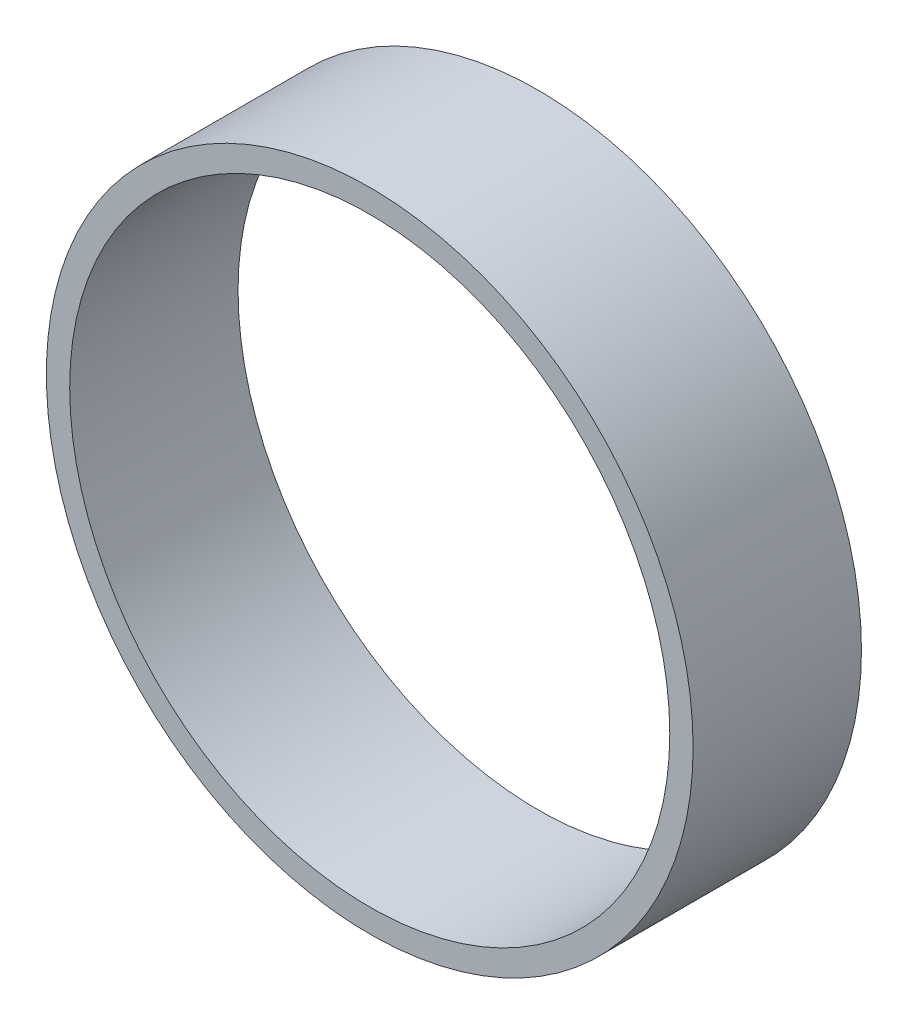
ISO-10303-21;
HEADER;
FILE_DESCRIPTION(('STEP AP214'),'2;1');
FILE_NAME('part.step','',(''),(''),'','','');
FILE_SCHEMA(('AUTOMOTIVE_DESIGN { 1 0 10303 214 1 1 1 1 }'));
ENDSEC;
DATA;
#1=APPLICATION_CONTEXT('core data for automotive mechanical design processes');
#2=APPLICATION_PROTOCOL_DEFINITION('international standard','automotive_design',2000,#1);
#3=PRODUCT_CONTEXT('',#1,'mechanical');
#4=PRODUCT('Part','Part','',(#3));
#5=PRODUCT_RELATED_PRODUCT_CATEGORY('part','',(#4));
#6=PRODUCT_DEFINITION_FORMATION('','',#4);
#7=PRODUCT_DEFINITION_CONTEXT('part definition',#1,'design');
#8=PRODUCT_DEFINITION('design','',#6,#7);
#9=PRODUCT_DEFINITION_SHAPE('','',#8);
#10=(LENGTH_UNIT() NAMED_UNIT(*) SI_UNIT(.MILLI.,.METRE.));
#11=(NAMED_UNIT(*) PLANE_ANGLE_UNIT() SI_UNIT($,.RADIAN.));
#12=(NAMED_UNIT(*) SI_UNIT($,.STERADIAN.) SOLID_ANGLE_UNIT());
#13=UNCERTAINTY_MEASURE_WITH_UNIT(LENGTH_MEASURE(1.E-05),#10,'distance_accuracy_value','');
#14=(GEOMETRIC_REPRESENTATION_CONTEXT(3) GLOBAL_UNCERTAINTY_ASSIGNED_CONTEXT((#13)) GLOBAL_UNIT_ASSIGNED_CONTEXT((#10,
#11,#12)) REPRESENTATION_CONTEXT('',''));
#15=CARTESIAN_POINT('',(0.,0.,0.));
#16=DIRECTION('',(0.,0.,1.));
#17=DIRECTION('',(1.,0.,0.));
#18=AXIS2_PLACEMENT_3D('',#15,#16,#17);
#19=CARTESIAN_POINT('',(0.,0.,25.654));
#20=DIRECTION('',(0.,0.,1.));
#21=DIRECTION('',(1.,0.,0.));
#22=AXIS2_PLACEMENT_3D('',#19,#20,#21);
#23=PLANE('',#22);
#24=CARTESIAN_POINT('',(0.,0.,25.654));
#25=DIRECTION('',(0.,0.,1.));
#26=DIRECTION('',(1.,0.,0.));
#27=AXIS2_PLACEMENT_3D('',#24,#25,#26);
#28=CIRCLE('',#27,49.276);
#29=CARTESIAN_POINT('',(49.276,0.,25.654));
#30=VERTEX_POINT('',#29);
#31=EDGE_CURVE('E10',#30,#30,#28,.T.);
#32=ORIENTED_EDGE('',*,*,#31,.T.);
#33=EDGE_LOOP('',(#32));
#34=FACE_BOUND('',#33,.T.);
#35=CARTESIAN_POINT('',(0.,0.,25.654));
#36=DIRECTION('',(0.,0.,1.));
#37=DIRECTION('',(1.,0.,0.));
#38=AXIS2_PLACEMENT_3D('',#35,#36,#37);
#39=CIRCLE('',#38,45.72);
#40=CARTESIAN_POINT('',(45.72,0.,25.654));
#41=VERTEX_POINT('',#40);
#42=EDGE_CURVE('E44',#41,#41,#39,.T.);
#43=ORIENTED_EDGE('',*,*,#42,.F.);
#44=EDGE_LOOP('',(#43));
#45=FACE_BOUND('',#44,.T.);
#46=ADVANCED_FACE('F33',(#34,#45),#23,.T.);
#47=CARTESIAN_POINT('',(0.,0.,0.));
#48=DIRECTION('',(0.,0.,1.));
#49=DIRECTION('',(1.,0.,0.));
#50=AXIS2_PLACEMENT_3D('',#47,#48,#49);
#51=PLANE('',#50);
#52=CARTESIAN_POINT('',(0.,0.,0.));
#53=DIRECTION('',(0.,0.,1.));
#54=DIRECTION('',(1.,0.,0.));
#55=AXIS2_PLACEMENT_3D('',#52,#53,#54);
#56=CIRCLE('',#55,49.276);
#57=CARTESIAN_POINT('',(49.276,0.,0.));
#58=VERTEX_POINT('',#57);
#59=EDGE_CURVE('E37',#58,#58,#56,.T.);
#60=ORIENTED_EDGE('',*,*,#59,.F.);
#61=EDGE_LOOP('',(#60));
#62=FACE_BOUND('',#61,.T.);
#63=CARTESIAN_POINT('',(0.,0.,0.));
#64=DIRECTION('',(0.,0.,1.));
#65=DIRECTION('',(1.,0.,0.));
#66=AXIS2_PLACEMENT_3D('',#63,#64,#65);
#67=CIRCLE('',#66,45.72);
#68=CARTESIAN_POINT('',(45.72,0.,0.));
#69=VERTEX_POINT('',#68);
#70=EDGE_CURVE('E46',#69,#69,#67,.T.);
#71=ORIENTED_EDGE('',*,*,#70,.T.);
#72=EDGE_LOOP('',(#71));
#73=FACE_BOUND('',#72,.T.);
#74=ADVANCED_FACE('F56',(#62,#73),#51,.F.);
#75=CARTESIAN_POINT('',(0.,0.,25.654));
#76=DIRECTION('',(0.,0.,-1.));
#77=DIRECTION('',(-1.,0.,0.));
#78=AXIS2_PLACEMENT_3D('',#75,#76,#77);
#79=CYLINDRICAL_SURFACE('',#78,49.276);
#80=ORIENTED_EDGE('',*,*,#31,.F.);
#81=EDGE_LOOP('',(#80));
#82=FACE_BOUND('',#81,.T.);
#83=ORIENTED_EDGE('',*,*,#59,.T.);
#84=EDGE_LOOP('',(#83));
#85=FACE_BOUND('',#84,.T.);
#86=ADVANCED_FACE('F35',(#82,#85),#79,.T.);
#87=CARTESIAN_POINT('',(0.,0.,25.654));
#88=DIRECTION('',(0.,0.,-1.));
#89=DIRECTION('',(-1.,0.,0.));
#90=AXIS2_PLACEMENT_3D('',#87,#88,#89);
#91=CYLINDRICAL_SURFACE('',#90,45.72);
#92=ORIENTED_EDGE('',*,*,#42,.T.);
#93=EDGE_LOOP('',(#92));
#94=FACE_BOUND('',#93,.T.);
#95=ORIENTED_EDGE('',*,*,#70,.F.);
#96=EDGE_LOOP('',(#95));
#97=FACE_BOUND('',#96,.T.);
#98=ADVANCED_FACE('F52',(#94,#97),#91,.F.);
#99=CLOSED_SHELL('',(#46,#74,#86,#98));
#100=MANIFOLD_SOLID_BREP('B2',#99);
#101=ADVANCED_BREP_SHAPE_REPRESENTATION('',(#18,#100),#14);
#102=SHAPE_DEFINITION_REPRESENTATION(#9,#101);
ENDSEC;
END-ISO-10303-21;
